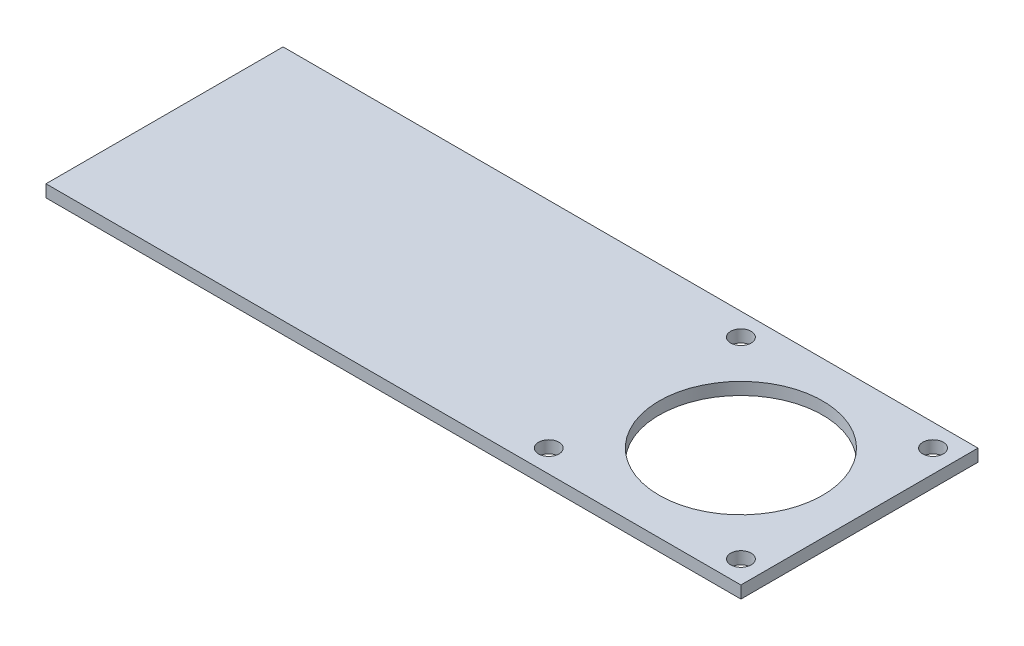
ISO-10303-21;
HEADER;
FILE_DESCRIPTION(('STEP AP214'),'2;1');
FILE_NAME('part.step','',(''),(''),'','','');
FILE_SCHEMA(('AUTOMOTIVE_DESIGN { 1 0 10303 214 1 1 1 1 }'));
ENDSEC;
DATA;
#1=APPLICATION_CONTEXT('core data for automotive mechanical design processes');
#2=APPLICATION_PROTOCOL_DEFINITION('international standard','automotive_design',2000,#1);
#3=PRODUCT_CONTEXT('',#1,'mechanical');
#4=PRODUCT('Part','Part','',(#3));
#5=PRODUCT_RELATED_PRODUCT_CATEGORY('part','',(#4));
#6=PRODUCT_DEFINITION_FORMATION('','',#4);
#7=PRODUCT_DEFINITION_CONTEXT('part definition',#1,'design');
#8=PRODUCT_DEFINITION('design','',#6,#7);
#9=PRODUCT_DEFINITION_SHAPE('','',#8);
#10=(LENGTH_UNIT() NAMED_UNIT(*) SI_UNIT(.MILLI.,.METRE.));
#11=(NAMED_UNIT(*) PLANE_ANGLE_UNIT() SI_UNIT($,.RADIAN.));
#12=(NAMED_UNIT(*) SI_UNIT($,.STERADIAN.) SOLID_ANGLE_UNIT());
#13=UNCERTAINTY_MEASURE_WITH_UNIT(LENGTH_MEASURE(1.E-05),#10,'distance_accuracy_value','');
#14=(GEOMETRIC_REPRESENTATION_CONTEXT(3) GLOBAL_UNCERTAINTY_ASSIGNED_CONTEXT((#13)) GLOBAL_UNIT_ASSIGNED_CONTEXT((#10,
#11,#12)) REPRESENTATION_CONTEXT('',''));
#15=CARTESIAN_POINT('',(0.,0.,0.));
#16=DIRECTION('',(0.,0.,1.));
#17=DIRECTION('',(1.,0.,0.));
#18=AXIS2_PLACEMENT_3D('',#15,#16,#17);
#19=CARTESIAN_POINT('',(-91.0636123638583,0.,58.));
#20=DIRECTION('',(1.,0.,0.));
#21=DIRECTION('',(0.,0.,-1.));
#22=AXIS2_PLACEMENT_3D('',#19,#20,#21);
#23=PLANE('',#22);
#24=DIRECTION('',(0.,-1.,0.));
#25=VECTOR('',#24,1.);
#26=CARTESIAN_POINT('',(-91.0636123638583,0.,0.));
#27=LINE('',#26,#25);
#28=CARTESIAN_POINT('',(-91.0636123638583,0.,0.));
#29=VERTEX_POINT('',#28);
#30=CARTESIAN_POINT('',(-91.0636123638583,-3.,0.));
#31=VERTEX_POINT('',#30);
#32=EDGE_CURVE('E96',#29,#31,#27,.T.);
#33=ORIENTED_EDGE('',*,*,#32,.T.);
#34=DIRECTION('',(0.,0.,-1.));
#35=VECTOR('',#34,1.);
#36=CARTESIAN_POINT('',(-91.0636123638583,-3.,58.));
#37=LINE('',#36,#35);
#38=CARTESIAN_POINT('',(-91.0636123638583,-3.,58.));
#39=VERTEX_POINT('',#38);
#40=EDGE_CURVE('E11',#39,#31,#37,.T.);
#41=ORIENTED_EDGE('',*,*,#40,.F.);
#42=DIRECTION('',(0.,-1.,0.));
#43=VECTOR('',#42,1.);
#44=CARTESIAN_POINT('',(-91.0636123638583,0.,58.));
#45=LINE('',#44,#43);
#46=CARTESIAN_POINT('',(-91.0636123638583,0.,58.));
#47=VERTEX_POINT('',#46);
#48=EDGE_CURVE('E84',#47,#39,#45,.T.);
#49=ORIENTED_EDGE('',*,*,#48,.F.);
#50=DIRECTION('',(0.,0.,-1.));
#51=VECTOR('',#50,1.);
#52=CARTESIAN_POINT('',(-91.0636123638583,0.,58.));
#53=LINE('',#52,#51);
#54=EDGE_CURVE('E92',#47,#29,#53,.T.);
#55=ORIENTED_EDGE('',*,*,#54,.T.);
#56=EDGE_LOOP('',(#33,#41,#49,#55));
#57=FACE_BOUND('',#56,.T.);
#58=ADVANCED_FACE('F33',(#57),#23,.F.);
#59=CARTESIAN_POINT('',(-91.0636123638583,-3.,58.));
#60=DIRECTION('',(0.,1.,0.));
#61=DIRECTION('',(0.,0.,1.));
#62=AXIS2_PLACEMENT_3D('',#59,#60,#61);
#63=PLANE('',#62);
#64=CARTESIAN_POINT('',(49.9363876361417,-3.,29.));
#65=DIRECTION('',(0.,1.,0.));
#66=DIRECTION('',(0.,0.,1.));
#67=AXIS2_PLACEMENT_3D('',#64,#65,#66);
#68=CIRCLE('',#67,20.);
#69=CARTESIAN_POINT('',(49.9363876361417,-3.,49.));
#70=VERTEX_POINT('',#69);
#71=EDGE_CURVE('E133',#70,#70,#68,.T.);
#72=ORIENTED_EDGE('',*,*,#71,.T.);
#73=EDGE_LOOP('',(#72));
#74=FACE_BOUND('',#73,.T.);
#75=CARTESIAN_POINT('',(26.4363876361417,-3.,5.50000000000003));
#76=DIRECTION('',(0.,1.,0.));
#77=DIRECTION('',(0.,0.,1.));
#78=AXIS2_PLACEMENT_3D('',#75,#76,#77);
#79=CIRCLE('',#78,2.5);
#80=CARTESIAN_POINT('',(26.4363876361417,-3.,8.00000000000003));
#81=VERTEX_POINT('',#80);
#82=EDGE_CURVE('E127',#81,#81,#79,.T.);
#83=ORIENTED_EDGE('',*,*,#82,.T.);
#84=EDGE_LOOP('',(#83));
#85=FACE_BOUND('',#84,.T.);
#86=CARTESIAN_POINT('',(26.4363876361417,-3.,52.5));
#87=DIRECTION('',(0.,1.,0.));
#88=DIRECTION('',(0.,0.,1.));
#89=AXIS2_PLACEMENT_3D('',#86,#87,#88);
#90=CIRCLE('',#89,2.5);
#91=CARTESIAN_POINT('',(26.4363876361417,-3.,55.));
#92=VERTEX_POINT('',#91);
#93=EDGE_CURVE('E121',#92,#92,#90,.T.);
#94=ORIENTED_EDGE('',*,*,#93,.T.);
#95=EDGE_LOOP('',(#94));
#96=FACE_BOUND('',#95,.T.);
#97=CARTESIAN_POINT('',(73.4363876361417,-3.,52.5));
#98=DIRECTION('',(0.,1.,0.));
#99=DIRECTION('',(0.,0.,1.));
#100=AXIS2_PLACEMENT_3D('',#97,#98,#99);
#101=CIRCLE('',#100,2.50000000000001);
#102=CARTESIAN_POINT('',(73.4363876361417,-3.,55.));
#103=VERTEX_POINT('',#102);
#104=EDGE_CURVE('E115',#103,#103,#101,.T.);
#105=ORIENTED_EDGE('',*,*,#104,.T.);
#106=EDGE_LOOP('',(#105));
#107=FACE_BOUND('',#106,.T.);
#108=CARTESIAN_POINT('',(73.4363876361417,-3.,5.5));
#109=DIRECTION('',(0.,1.,0.));
#110=DIRECTION('',(0.,0.,1.));
#111=AXIS2_PLACEMENT_3D('',#108,#109,#110);
#112=CIRCLE('',#111,2.50000000000001);
#113=CARTESIAN_POINT('',(73.4363876361417,-3.,8.00000000000001));
#114=VERTEX_POINT('',#113);
#115=EDGE_CURVE('E99',#114,#114,#112,.T.);
#116=ORIENTED_EDGE('',*,*,#115,.T.);
#117=EDGE_LOOP('',(#116));
#118=FACE_BOUND('',#117,.T.);
#119=DIRECTION('',(1.,0.,0.));
#120=VECTOR('',#119,1.);
#121=CARTESIAN_POINT('',(-91.0636123638583,-3.,0.));
#122=LINE('',#121,#120);
#123=CARTESIAN_POINT('',(78.9363876361417,-3.,0.));
#124=VERTEX_POINT('',#123);
#125=EDGE_CURVE('E88',#31,#124,#122,.T.);
#126=ORIENTED_EDGE('',*,*,#125,.T.);
#127=DIRECTION('',(0.,0.,-1.));
#128=VECTOR('',#127,1.);
#129=CARTESIAN_POINT('',(78.9363876361417,-3.,58.));
#130=LINE('',#129,#128);
#131=CARTESIAN_POINT('',(78.9363876361417,-3.,58.));
#132=VERTEX_POINT('',#131);
#133=EDGE_CURVE('E41',#132,#124,#130,.T.);
#134=ORIENTED_EDGE('',*,*,#133,.F.);
#135=DIRECTION('',(1.,0.,0.));
#136=VECTOR('',#135,1.);
#137=CARTESIAN_POINT('',(-91.0636123638583,-3.,58.));
#138=LINE('',#137,#136);
#139=EDGE_CURVE('E79',#39,#132,#138,.T.);
#140=ORIENTED_EDGE('',*,*,#139,.F.);
#141=ORIENTED_EDGE('',*,*,#40,.T.);
#142=EDGE_LOOP('',(#126,#134,#140,#141));
#143=FACE_BOUND('',#142,.T.);
#144=ADVANCED_FACE('F87',(#74,#85,#96,#107,#118,#143),#63,.F.);
#145=CARTESIAN_POINT('',(78.9363876361417,0.,58.));
#146=DIRECTION('',(-1.,0.,0.));
#147=DIRECTION('',(0.,0.,1.));
#148=AXIS2_PLACEMENT_3D('',#145,#146,#147);
#149=PLANE('',#148);
#150=DIRECTION('',(0.,1.,0.));
#151=VECTOR('',#150,1.);
#152=CARTESIAN_POINT('',(78.9363876361417,0.,0.));
#153=LINE('',#152,#151);
#154=CARTESIAN_POINT('',(78.9363876361417,0.,0.));
#155=VERTEX_POINT('',#154);
#156=EDGE_CURVE('E66',#124,#155,#153,.T.);
#157=ORIENTED_EDGE('',*,*,#156,.T.);
#158=DIRECTION('',(0.,0.,-1.));
#159=VECTOR('',#158,1.);
#160=CARTESIAN_POINT('',(78.9363876361417,0.,58.));
#161=LINE('',#160,#159);
#162=CARTESIAN_POINT('',(78.9363876361417,0.,58.));
#163=VERTEX_POINT('',#162);
#164=EDGE_CURVE('E89',#163,#155,#161,.T.);
#165=ORIENTED_EDGE('',*,*,#164,.F.);
#166=DIRECTION('',(0.,1.,0.));
#167=VECTOR('',#166,1.);
#168=CARTESIAN_POINT('',(78.9363876361417,0.,58.));
#169=LINE('',#168,#167);
#170=EDGE_CURVE('E82',#132,#163,#169,.T.);
#171=ORIENTED_EDGE('',*,*,#170,.F.);
#172=ORIENTED_EDGE('',*,*,#133,.T.);
#173=EDGE_LOOP('',(#157,#165,#171,#172));
#174=FACE_BOUND('',#173,.T.);
#175=ADVANCED_FACE('F90',(#174),#149,.F.);
#176=CARTESIAN_POINT('',(-91.0636123638583,0.,58.));
#177=DIRECTION('',(0.,-1.,0.));
#178=DIRECTION('',(0.,0.,-1.));
#179=AXIS2_PLACEMENT_3D('',#176,#177,#178);
#180=PLANE('',#179);
#181=CARTESIAN_POINT('',(49.9363876361417,0.,29.));
#182=DIRECTION('',(0.,1.,0.));
#183=DIRECTION('',(0.,0.,1.));
#184=AXIS2_PLACEMENT_3D('',#181,#182,#183);
#185=CIRCLE('',#184,20.);
#186=CARTESIAN_POINT('',(49.9363876361417,0.,49.));
#187=VERTEX_POINT('',#186);
#188=EDGE_CURVE('E136',#187,#187,#185,.T.);
#189=ORIENTED_EDGE('',*,*,#188,.F.);
#190=EDGE_LOOP('',(#189));
#191=FACE_BOUND('',#190,.T.);
#192=CARTESIAN_POINT('',(26.4363876361417,0.,5.50000000000003));
#193=DIRECTION('',(0.,1.,0.));
#194=DIRECTION('',(0.,0.,-1.));
#195=AXIS2_PLACEMENT_3D('',#192,#193,#194);
#196=CIRCLE('',#195,2.5);
#197=CARTESIAN_POINT('',(26.4363876361417,0.,3.00000000000003));
#198=VERTEX_POINT('',#197);
#199=EDGE_CURVE('E130',#198,#198,#196,.T.);
#200=ORIENTED_EDGE('',*,*,#199,.F.);
#201=EDGE_LOOP('',(#200));
#202=FACE_BOUND('',#201,.T.);
#203=CARTESIAN_POINT('',(26.4363876361417,0.,52.5));
#204=DIRECTION('',(0.,1.,0.));
#205=DIRECTION('',(0.,0.,1.));
#206=AXIS2_PLACEMENT_3D('',#203,#204,#205);
#207=CIRCLE('',#206,2.5);
#208=CARTESIAN_POINT('',(26.4363876361417,0.,55.));
#209=VERTEX_POINT('',#208);
#210=EDGE_CURVE('E124',#209,#209,#207,.T.);
#211=ORIENTED_EDGE('',*,*,#210,.F.);
#212=EDGE_LOOP('',(#211));
#213=FACE_BOUND('',#212,.T.);
#214=CARTESIAN_POINT('',(73.4363876361417,0.,52.5));
#215=DIRECTION('',(0.,1.,0.));
#216=DIRECTION('',(0.,0.,-1.));
#217=AXIS2_PLACEMENT_3D('',#214,#215,#216);
#218=CIRCLE('',#217,2.50000000000001);
#219=CARTESIAN_POINT('',(73.4363876361417,0.,50.));
#220=VERTEX_POINT('',#219);
#221=EDGE_CURVE('E118',#220,#220,#218,.T.);
#222=ORIENTED_EDGE('',*,*,#221,.F.);
#223=EDGE_LOOP('',(#222));
#224=FACE_BOUND('',#223,.T.);
#225=CARTESIAN_POINT('',(73.4363876361417,0.,5.5));
#226=DIRECTION('',(0.,1.,0.));
#227=DIRECTION('',(0.,0.,1.));
#228=AXIS2_PLACEMENT_3D('',#225,#226,#227);
#229=CIRCLE('',#228,2.50000000000001);
#230=CARTESIAN_POINT('',(73.4363876361417,0.,8.00000000000001));
#231=VERTEX_POINT('',#230);
#232=EDGE_CURVE('E112',#231,#231,#229,.T.);
#233=ORIENTED_EDGE('',*,*,#232,.F.);
#234=EDGE_LOOP('',(#233));
#235=FACE_BOUND('',#234,.T.);
#236=DIRECTION('',(-1.,0.,0.));
#237=VECTOR('',#236,1.);
#238=CARTESIAN_POINT('',(-91.0636123638583,0.,0.));
#239=LINE('',#238,#237);
#240=EDGE_CURVE('E72',#155,#29,#239,.T.);
#241=ORIENTED_EDGE('',*,*,#240,.T.);
#242=ORIENTED_EDGE('',*,*,#54,.F.);
#243=DIRECTION('',(-1.,0.,0.));
#244=VECTOR('',#243,1.);
#245=CARTESIAN_POINT('',(-91.0636123638583,0.,58.));
#246=LINE('',#245,#244);
#247=EDGE_CURVE('E49',#163,#47,#246,.T.);
#248=ORIENTED_EDGE('',*,*,#247,.F.);
#249=ORIENTED_EDGE('',*,*,#164,.T.);
#250=EDGE_LOOP('',(#241,#242,#248,#249));
#251=FACE_BOUND('',#250,.T.);
#252=ADVANCED_FACE('F104',(#191,#202,#213,#224,#235,#251),#180,.F.);
#253=CARTESIAN_POINT('',(0.,0.,58.));
#254=DIRECTION('',(0.,0.,1.));
#255=DIRECTION('',(1.,0.,0.));
#256=AXIS2_PLACEMENT_3D('',#253,#254,#255);
#257=PLANE('',#256);
#258=ORIENTED_EDGE('',*,*,#48,.T.);
#259=ORIENTED_EDGE('',*,*,#139,.T.);
#260=ORIENTED_EDGE('',*,*,#170,.T.);
#261=ORIENTED_EDGE('',*,*,#247,.T.);
#262=EDGE_LOOP('',(#258,#259,#260,#261));
#263=FACE_BOUND('',#262,.T.);
#264=ADVANCED_FACE('F80',(#263),#257,.T.);
#265=CARTESIAN_POINT('',(0.,0.,0.));
#266=DIRECTION('',(0.,0.,1.));
#267=DIRECTION('',(1.,0.,0.));
#268=AXIS2_PLACEMENT_3D('',#265,#266,#267);
#269=PLANE('',#268);
#270=ORIENTED_EDGE('',*,*,#32,.F.);
#271=ORIENTED_EDGE('',*,*,#240,.F.);
#272=ORIENTED_EDGE('',*,*,#156,.F.);
#273=ORIENTED_EDGE('',*,*,#125,.F.);
#274=EDGE_LOOP('',(#270,#271,#272,#273));
#275=FACE_BOUND('',#274,.T.);
#276=ADVANCED_FACE('F107',(#275),#269,.F.);
#277=CARTESIAN_POINT('',(73.4363876361417,-58.,5.5));
#278=DIRECTION('',(0.,1.,0.));
#279=DIRECTION('',(0.,0.,1.));
#280=AXIS2_PLACEMENT_3D('',#277,#278,#279);
#281=CYLINDRICAL_SURFACE('',#280,2.50000000000001);
#282=ORIENTED_EDGE('',*,*,#232,.T.);
#283=EDGE_LOOP('',(#282));
#284=FACE_BOUND('',#283,.T.);
#285=ORIENTED_EDGE('',*,*,#115,.F.);
#286=EDGE_LOOP('',(#285));
#287=FACE_BOUND('',#286,.T.);
#288=ADVANCED_FACE('F154',(#284,#287),#281,.F.);
#289=CARTESIAN_POINT('',(73.4363876361417,-58.,52.5));
#290=DIRECTION('',(0.,1.,0.));
#291=DIRECTION('',(0.,0.,1.));
#292=AXIS2_PLACEMENT_3D('',#289,#290,#291);
#293=CYLINDRICAL_SURFACE('',#292,2.50000000000001);
#294=ORIENTED_EDGE('',*,*,#221,.T.);
#295=EDGE_LOOP('',(#294));
#296=FACE_BOUND('',#295,.T.);
#297=ORIENTED_EDGE('',*,*,#104,.F.);
#298=EDGE_LOOP('',(#297));
#299=FACE_BOUND('',#298,.T.);
#300=ADVANCED_FACE('F157',(#296,#299),#293,.F.);
#301=CARTESIAN_POINT('',(26.4363876361417,-58.,52.5));
#302=DIRECTION('',(0.,1.,0.));
#303=DIRECTION('',(0.,0.,1.));
#304=AXIS2_PLACEMENT_3D('',#301,#302,#303);
#305=CYLINDRICAL_SURFACE('',#304,2.5);
#306=ORIENTED_EDGE('',*,*,#210,.T.);
#307=EDGE_LOOP('',(#306));
#308=FACE_BOUND('',#307,.T.);
#309=ORIENTED_EDGE('',*,*,#93,.F.);
#310=EDGE_LOOP('',(#309));
#311=FACE_BOUND('',#310,.T.);
#312=ADVANCED_FACE('F176',(#308,#311),#305,.F.);
#313=CARTESIAN_POINT('',(26.4363876361417,-58.,5.50000000000003));
#314=DIRECTION('',(0.,1.,0.));
#315=DIRECTION('',(0.,0.,1.));
#316=AXIS2_PLACEMENT_3D('',#313,#314,#315);
#317=CYLINDRICAL_SURFACE('',#316,2.5);
#318=ORIENTED_EDGE('',*,*,#199,.T.);
#319=EDGE_LOOP('',(#318));
#320=FACE_BOUND('',#319,.T.);
#321=ORIENTED_EDGE('',*,*,#82,.F.);
#322=EDGE_LOOP('',(#321));
#323=FACE_BOUND('',#322,.T.);
#324=ADVANCED_FACE('F180',(#320,#323),#317,.F.);
#325=CARTESIAN_POINT('',(49.9363876361417,-58.,29.));
#326=DIRECTION('',(0.,1.,0.));
#327=DIRECTION('',(0.,0.,1.));
#328=AXIS2_PLACEMENT_3D('',#325,#326,#327);
#329=CYLINDRICAL_SURFACE('',#328,20.);
#330=ORIENTED_EDGE('',*,*,#188,.T.);
#331=EDGE_LOOP('',(#330));
#332=FACE_BOUND('',#331,.T.);
#333=ORIENTED_EDGE('',*,*,#71,.F.);
#334=EDGE_LOOP('',(#333));
#335=FACE_BOUND('',#334,.T.);
#336=ADVANCED_FACE('F140',(#332,#335),#329,.F.);
#337=CLOSED_SHELL('',(#58,#144,#175,#252,#264,#276,#288,#300,#312,#324,#336));
#338=MANIFOLD_SOLID_BREP('B2',#337);
#339=ADVANCED_BREP_SHAPE_REPRESENTATION('',(#18,#338),#14);
#340=SHAPE_DEFINITION_REPRESENTATION(#9,#339);
ENDSEC;
END-ISO-10303-21;
